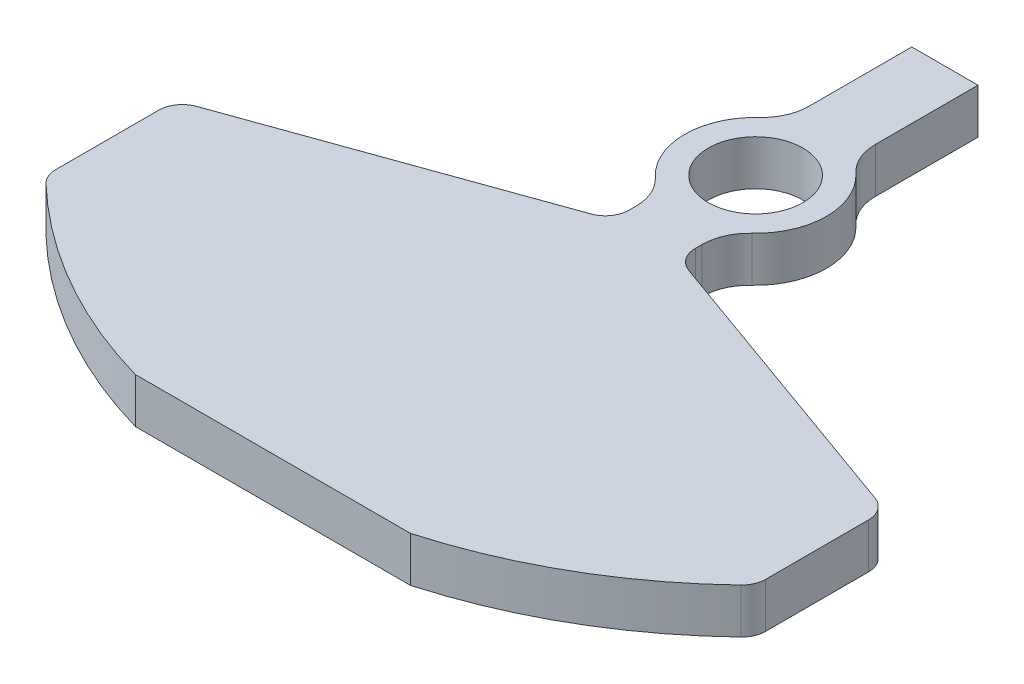
ISO-10303-21;
HEADER;
FILE_DESCRIPTION(('STEP AP214'),'2;1');
FILE_NAME('part.step','',(''),(''),'','','');
FILE_SCHEMA(('AUTOMOTIVE_DESIGN { 1 0 10303 214 1 1 1 1 }'));
ENDSEC;
DATA;
#1=APPLICATION_CONTEXT('core data for automotive mechanical design processes');
#2=APPLICATION_PROTOCOL_DEFINITION('international standard','automotive_design',2000,#1);
#3=PRODUCT_CONTEXT('',#1,'mechanical');
#4=PRODUCT('Part','Part','',(#3));
#5=PRODUCT_RELATED_PRODUCT_CATEGORY('part','',(#4));
#6=PRODUCT_DEFINITION_FORMATION('','',#4);
#7=PRODUCT_DEFINITION_CONTEXT('part definition',#1,'design');
#8=PRODUCT_DEFINITION('design','',#6,#7);
#9=PRODUCT_DEFINITION_SHAPE('','',#8);
#10=(LENGTH_UNIT() NAMED_UNIT(*) SI_UNIT(.MILLI.,.METRE.));
#11=(NAMED_UNIT(*) PLANE_ANGLE_UNIT() SI_UNIT($,.RADIAN.));
#12=(NAMED_UNIT(*) SI_UNIT($,.STERADIAN.) SOLID_ANGLE_UNIT());
#13=UNCERTAINTY_MEASURE_WITH_UNIT(LENGTH_MEASURE(1.E-05),#10,'distance_accuracy_value','');
#14=(GEOMETRIC_REPRESENTATION_CONTEXT(3) GLOBAL_UNCERTAINTY_ASSIGNED_CONTEXT((#13)) GLOBAL_UNIT_ASSIGNED_CONTEXT((#10,
#11,#12)) REPRESENTATION_CONTEXT('',''));
#15=CARTESIAN_POINT('',(0.,0.,0.));
#16=DIRECTION('',(0.,0.,1.));
#17=DIRECTION('',(1.,0.,0.));
#18=AXIS2_PLACEMENT_3D('',#15,#16,#17);
#19=CARTESIAN_POINT('',(0.,9.525,0.));
#20=DIRECTION('',(0.,1.,0.));
#21=DIRECTION('',(0.,0.,1.));
#22=AXIS2_PLACEMENT_3D('',#19,#20,#21);
#23=PLANE('',#22);
#24=CARTESIAN_POINT('',(0.,9.525,0.));
#25=DIRECTION('',(0.,1.,0.));
#26=DIRECTION('',(0.,0.,1.));
#27=AXIS2_PLACEMENT_3D('',#24,#25,#26);
#28=CIRCLE('',#27,106.066017177982);
#29=CARTESIAN_POINT('',(29.086079144498,9.525,102.));
#30=VERTEX_POINT('',#29);
#31=CARTESIAN_POINT('',(73.4630829409616,9.525,76.5060484197779));
#32=VERTEX_POINT('',#31);
#33=EDGE_CURVE('E238',#30,#32,#28,.T.);
#34=ORIENTED_EDGE('',*,*,#33,.T.);
#35=CARTESIAN_POINT('',(70.,9.525,72.8995187104838));
#36=DIRECTION('',(0.,1.,0.));
#37=DIRECTION('',(0.,0.,1.));
#38=AXIS2_PLACEMENT_3D('',#35,#36,#37);
#39=CIRCLE('',#38,5.);
#40=CARTESIAN_POINT('',(75.,9.525,72.8995187104838));
#41=VERTEX_POINT('',#40);
#42=EDGE_CURVE('E368',#32,#41,#39,.T.);
#43=ORIENTED_EDGE('',*,*,#42,.T.);
#44=DIRECTION('',(0.,0.,-1.));
#45=VECTOR('',#44,1.);
#46=CARTESIAN_POINT('',(75.,9.525,47.6323364101277));
#47=LINE('',#46,#45);
#48=CARTESIAN_POINT('',(75.,9.525,51.1520253851288));
#49=VERTEX_POINT('',#48);
#50=EDGE_CURVE('E241',#41,#49,#47,.T.);
#51=ORIENTED_EDGE('',*,*,#50,.T.);
#52=CARTESIAN_POINT('',(70.,9.525,51.1520253851288));
#53=DIRECTION('',(0.,1.,0.));
#54=DIRECTION('',(0.,0.,1.));
#55=AXIS2_PLACEMENT_3D('',#52,#53,#54);
#56=CIRCLE('',#55,5.);
#57=CARTESIAN_POINT('',(71.686599780665,9.525,46.4450750794786));
#58=VERTEX_POINT('',#57);
#59=EDGE_CURVE('E365',#49,#58,#56,.T.);
#60=ORIENTED_EDGE('',*,*,#59,.T.);
#61=DIRECTION('',(-0.941390061130045,0.,-0.337319956133003));
#62=VECTOR('',#61,1.);
#63=CARTESIAN_POINT('',(6.99999999999999,9.525,23.2664991614216));
#64=LINE('',#63,#62);
#65=CARTESIAN_POINT('',(10.313400219335,9.525,24.4537604920708));
#66=VERTEX_POINT('',#65);
#67=EDGE_CURVE('E244',#58,#66,#64,.T.);
#68=ORIENTED_EDGE('',*,*,#67,.T.);
#69=CARTESIAN_POINT('',(12.,9.525,19.7468101864206));
#70=DIRECTION('',(0.,1.,0.));
#71=DIRECTION('',(0.,0.,1.));
#72=AXIS2_PLACEMENT_3D('',#69,#70,#71);
#73=CIRCLE('',#72,5.);
#74=CARTESIAN_POINT('',(7.,9.525,19.7468101864205));
#75=VERTEX_POINT('',#74);
#76=EDGE_CURVE('E386',#66,#75,#73,.F.);
#77=ORIENTED_EDGE('',*,*,#76,.T.);
#78=DIRECTION('',(0.,0.,-1.));
#79=VECTOR('',#78,1.);
#80=CARTESIAN_POINT('',(7.,9.525,13.2664991614216));
#81=LINE('',#80,#79);
#82=CARTESIAN_POINT('',(7.,9.525,18.3303027798234));
#83=VERTEX_POINT('',#82);
#84=EDGE_CURVE('E247',#75,#83,#81,.T.);
#85=ORIENTED_EDGE('',*,*,#84,.T.);
#86=CARTESIAN_POINT('',(17.,9.525,18.3303027798234));
#87=DIRECTION('',(0.,1.,0.));
#88=DIRECTION('',(0.,0.,1.));
#89=AXIS2_PLACEMENT_3D('',#86,#87,#88);
#90=CIRCLE('',#89,10.);
#91=CARTESIAN_POINT('',(10.2,9.525,10.998181667894));
#92=VERTEX_POINT('',#91);
#93=EDGE_CURVE('E334',#83,#92,#90,.F.);
#94=ORIENTED_EDGE('',*,*,#93,.T.);
#95=CARTESIAN_POINT('',(0.,9.525,0.));
#96=DIRECTION('',(0.,1.,0.));
#97=DIRECTION('',(0.,0.,1.));
#98=AXIS2_PLACEMENT_3D('',#95,#96,#97);
#99=CIRCLE('',#98,15.);
#100=CARTESIAN_POINT('',(10.2,9.525,-10.998181667894));
#101=VERTEX_POINT('',#100);
#102=EDGE_CURVE('E249',#92,#101,#99,.T.);
#103=ORIENTED_EDGE('',*,*,#102,.T.);
#104=CARTESIAN_POINT('',(17.,9.525,-18.3303027798234));
#105=DIRECTION('',(0.,1.,0.));
#106=DIRECTION('',(0.,0.,1.));
#107=AXIS2_PLACEMENT_3D('',#104,#105,#106);
#108=CIRCLE('',#107,10.);
#109=CARTESIAN_POINT('',(7.,9.525,-18.3303027798234));
#110=VERTEX_POINT('',#109);
#111=EDGE_CURVE('E329',#101,#110,#108,.F.);
#112=ORIENTED_EDGE('',*,*,#111,.T.);
#113=DIRECTION('',(0.,0.,-1.));
#114=VECTOR('',#113,1.);
#115=CARTESIAN_POINT('',(7.,9.525,-40.));
#116=LINE('',#115,#114);
#117=CARTESIAN_POINT('',(7.,9.525,-40.));
#118=VERTEX_POINT('',#117);
#119=EDGE_CURVE('E252',#110,#118,#116,.T.);
#120=ORIENTED_EDGE('',*,*,#119,.T.);
#121=DIRECTION('',(-1.,0.,0.));
#122=VECTOR('',#121,1.);
#123=CARTESIAN_POINT('',(-7.,9.525,-40.));
#124=LINE('',#123,#122);
#125=CARTESIAN_POINT('',(-7.,9.525,-40.));
#126=VERTEX_POINT('',#125);
#127=EDGE_CURVE('E254',#118,#126,#124,.T.);
#128=ORIENTED_EDGE('',*,*,#127,.T.);
#129=DIRECTION('',(0.,0.,1.));
#130=VECTOR('',#129,1.);
#131=CARTESIAN_POINT('',(-7.,9.525,-40.));
#132=LINE('',#131,#130);
#133=CARTESIAN_POINT('',(-7.,9.525,-18.3303027798234));
#134=VERTEX_POINT('',#133);
#135=EDGE_CURVE('E219',#126,#134,#132,.T.);
#136=ORIENTED_EDGE('',*,*,#135,.T.);
#137=CARTESIAN_POINT('',(-17.,9.525,-18.3303027798234));
#138=DIRECTION('',(0.,1.,0.));
#139=DIRECTION('',(0.,0.,1.));
#140=AXIS2_PLACEMENT_3D('',#137,#138,#139);
#141=CIRCLE('',#140,10.);
#142=CARTESIAN_POINT('',(-10.2,9.525,-10.998181667894));
#143=VERTEX_POINT('',#142);
#144=EDGE_CURVE('E325',#134,#143,#141,.F.);
#145=ORIENTED_EDGE('',*,*,#144,.T.);
#146=CARTESIAN_POINT('',(0.,9.525,0.));
#147=DIRECTION('',(0.,1.,0.));
#148=DIRECTION('',(0.,0.,1.));
#149=AXIS2_PLACEMENT_3D('',#146,#147,#148);
#150=CIRCLE('',#149,15.);
#151=CARTESIAN_POINT('',(-10.2,9.525,10.998181667894));
#152=VERTEX_POINT('',#151);
#153=EDGE_CURVE('E222',#143,#152,#150,.T.);
#154=ORIENTED_EDGE('',*,*,#153,.T.);
#155=CARTESIAN_POINT('',(-17.,9.525,18.3303027798234));
#156=DIRECTION('',(0.,1.,0.));
#157=DIRECTION('',(0.,0.,1.));
#158=AXIS2_PLACEMENT_3D('',#155,#156,#157);
#159=CIRCLE('',#158,10.);
#160=CARTESIAN_POINT('',(-7.,9.525,18.3303027798234));
#161=VERTEX_POINT('',#160);
#162=EDGE_CURVE('E338',#152,#161,#159,.F.);
#163=ORIENTED_EDGE('',*,*,#162,.T.);
#164=DIRECTION('',(0.,0.,1.));
#165=VECTOR('',#164,1.);
#166=CARTESIAN_POINT('',(-7.,9.525,13.2664991614216));
#167=LINE('',#166,#165);
#168=CARTESIAN_POINT('',(-7.,9.525,19.7468101864205));
#169=VERTEX_POINT('',#168);
#170=EDGE_CURVE('E226',#161,#169,#167,.T.);
#171=ORIENTED_EDGE('',*,*,#170,.T.);
#172=CARTESIAN_POINT('',(-12.,9.525,19.7468101864205));
#173=DIRECTION('',(0.,1.,0.));
#174=DIRECTION('',(0.,0.,1.));
#175=AXIS2_PLACEMENT_3D('',#172,#173,#174);
#176=CIRCLE('',#175,5.);
#177=CARTESIAN_POINT('',(-10.313400219335,9.525,24.4537604920708));
#178=VERTEX_POINT('',#177);
#179=EDGE_CURVE('E11',#169,#178,#176,.F.);
#180=ORIENTED_EDGE('',*,*,#179,.T.);
#181=DIRECTION('',(-0.941390061130045,0.,0.337319956133003));
#182=VECTOR('',#181,1.);
#183=CARTESIAN_POINT('',(-75.,9.525,47.6323364101277));
#184=LINE('',#183,#182);
#185=CARTESIAN_POINT('',(-71.686599780665,9.525,46.4450750794786));
#186=VERTEX_POINT('',#185);
#187=EDGE_CURVE('E229',#178,#186,#184,.T.);
#188=ORIENTED_EDGE('',*,*,#187,.T.);
#189=CARTESIAN_POINT('',(-70.,9.525,51.1520253851288));
#190=DIRECTION('',(0.,1.,0.));
#191=DIRECTION('',(0.,0.,1.));
#192=AXIS2_PLACEMENT_3D('',#189,#190,#191);
#193=CIRCLE('',#192,5.);
#194=CARTESIAN_POINT('',(-75.,9.525,51.1520253851288));
#195=VERTEX_POINT('',#194);
#196=EDGE_CURVE('E363',#186,#195,#193,.T.);
#197=ORIENTED_EDGE('',*,*,#196,.T.);
#198=DIRECTION('',(0.,0.,1.));
#199=VECTOR('',#198,1.);
#200=CARTESIAN_POINT('',(-75.,9.525,47.6323364101277));
#201=LINE('',#200,#199);
#202=CARTESIAN_POINT('',(-75.,9.525,72.8995187104838));
#203=VERTEX_POINT('',#202);
#204=EDGE_CURVE('E232',#195,#203,#201,.T.);
#205=ORIENTED_EDGE('',*,*,#204,.T.);
#206=CARTESIAN_POINT('',(-70.,9.525,72.8995187104838));
#207=DIRECTION('',(0.,1.,0.));
#208=DIRECTION('',(0.,0.,1.));
#209=AXIS2_PLACEMENT_3D('',#206,#207,#208);
#210=CIRCLE('',#209,5.);
#211=CARTESIAN_POINT('',(-73.4630829409616,9.525,76.5060484197779));
#212=VERTEX_POINT('',#211);
#213=EDGE_CURVE('E50',#203,#212,#210,.T.);
#214=ORIENTED_EDGE('',*,*,#213,.T.);
#215=CARTESIAN_POINT('',(0.,9.525,0.));
#216=DIRECTION('',(0.,1.,0.));
#217=DIRECTION('',(0.,0.,1.));
#218=AXIS2_PLACEMENT_3D('',#215,#216,#217);
#219=CIRCLE('',#218,106.066017177982);
#220=CARTESIAN_POINT('',(-29.086079144498,9.525,102.));
#221=VERTEX_POINT('',#220);
#222=EDGE_CURVE('E234',#212,#221,#219,.T.);
#223=ORIENTED_EDGE('',*,*,#222,.T.);
#224=DIRECTION('',(1.,0.,0.));
#225=VECTOR('',#224,1.);
#226=CARTESIAN_POINT('',(-29.086079144498,9.525,102.));
#227=LINE('',#226,#225);
#228=EDGE_CURVE('E236',#221,#30,#227,.T.);
#229=ORIENTED_EDGE('',*,*,#228,.T.);
#230=EDGE_LOOP('',(#34,#43,#51,#60,#68,#77,#85,#94,#103,#112,#120,#128,#136,#145,#154,#163,#171,
#180,#188,#197,#205,#214,#223,#229));
#231=FACE_BOUND('',#230,.T.);
#232=CARTESIAN_POINT('',(0.,9.525,0.));
#233=DIRECTION('',(0.,1.,0.));
#234=DIRECTION('',(0.,0.,1.));
#235=AXIS2_PLACEMENT_3D('',#232,#233,#234);
#236=CIRCLE('',#235,10.);
#237=CARTESIAN_POINT('',(0.,9.525,10.));
#238=VERTEX_POINT('',#237);
#239=EDGE_CURVE('E211',#238,#238,#236,.T.);
#240=ORIENTED_EDGE('',*,*,#239,.F.);
#241=EDGE_LOOP('',(#240));
#242=FACE_BOUND('',#241,.T.);
#243=ADVANCED_FACE('F35',(#231,#242),#23,.T.);
#244=CARTESIAN_POINT('',(0.,0.,0.));
#245=DIRECTION('',(0.,1.,0.));
#246=DIRECTION('',(0.,0.,1.));
#247=AXIS2_PLACEMENT_3D('',#244,#245,#246);
#248=PLANE('',#247);
#249=DIRECTION('',(0.,0.,-1.));
#250=VECTOR('',#249,1.);
#251=CARTESIAN_POINT('',(75.,0.,47.6323364101277));
#252=LINE('',#251,#250);
#253=CARTESIAN_POINT('',(75.,0.,72.8995187104838));
#254=VERTEX_POINT('',#253);
#255=CARTESIAN_POINT('',(75.,0.,51.1520253851288));
#256=VERTEX_POINT('',#255);
#257=EDGE_CURVE('E277',#254,#256,#252,.T.);
#258=ORIENTED_EDGE('',*,*,#257,.F.);
#259=CARTESIAN_POINT('',(70.,0.,72.8995187104838));
#260=DIRECTION('',(0.,1.,0.));
#261=DIRECTION('',(0.,0.,1.));
#262=AXIS2_PLACEMENT_3D('',#259,#260,#261);
#263=CIRCLE('',#262,5.);
#264=CARTESIAN_POINT('',(73.4630829409616,0.,76.5060484197779));
#265=VERTEX_POINT('',#264);
#266=EDGE_CURVE('E359',#254,#265,#263,.F.);
#267=ORIENTED_EDGE('',*,*,#266,.T.);
#268=CARTESIAN_POINT('',(0.,0.,0.));
#269=DIRECTION('',(0.,1.,0.));
#270=DIRECTION('',(0.,0.,1.));
#271=AXIS2_PLACEMENT_3D('',#268,#269,#270);
#272=CIRCLE('',#271,106.066017177982);
#273=CARTESIAN_POINT('',(29.086079144498,0.,102.));
#274=VERTEX_POINT('',#273);
#275=EDGE_CURVE('E274',#274,#265,#272,.T.);
#276=ORIENTED_EDGE('',*,*,#275,.F.);
#277=DIRECTION('',(1.,0.,0.));
#278=VECTOR('',#277,1.);
#279=CARTESIAN_POINT('',(-29.086079144498,0.,102.));
#280=LINE('',#279,#278);
#281=CARTESIAN_POINT('',(-29.086079144498,0.,102.));
#282=VERTEX_POINT('',#281);
#283=EDGE_CURVE('E272',#282,#274,#280,.T.);
#284=ORIENTED_EDGE('',*,*,#283,.F.);
#285=CARTESIAN_POINT('',(0.,0.,0.));
#286=DIRECTION('',(0.,1.,0.));
#287=DIRECTION('',(0.,0.,1.));
#288=AXIS2_PLACEMENT_3D('',#285,#286,#287);
#289=CIRCLE('',#288,106.066017177982);
#290=CARTESIAN_POINT('',(-73.4630829409616,0.,76.5060484197779));
#291=VERTEX_POINT('',#290);
#292=EDGE_CURVE('E270',#291,#282,#289,.T.);
#293=ORIENTED_EDGE('',*,*,#292,.F.);
#294=CARTESIAN_POINT('',(-70.,0.,72.8995187104838));
#295=DIRECTION('',(0.,1.,0.));
#296=DIRECTION('',(0.,0.,1.));
#297=AXIS2_PLACEMENT_3D('',#294,#295,#296);
#298=CIRCLE('',#297,5.);
#299=CARTESIAN_POINT('',(-75.,0.,72.8995187104838));
#300=VERTEX_POINT('',#299);
#301=EDGE_CURVE('E357',#291,#300,#298,.F.);
#302=ORIENTED_EDGE('',*,*,#301,.T.);
#303=DIRECTION('',(0.,0.,1.));
#304=VECTOR('',#303,1.);
#305=CARTESIAN_POINT('',(-75.,0.,47.6323364101277));
#306=LINE('',#305,#304);
#307=CARTESIAN_POINT('',(-75.,0.,51.1520253851288));
#308=VERTEX_POINT('',#307);
#309=EDGE_CURVE('E268',#308,#300,#306,.T.);
#310=ORIENTED_EDGE('',*,*,#309,.F.);
#311=CARTESIAN_POINT('',(-70.,0.,51.1520253851288));
#312=DIRECTION('',(0.,1.,0.));
#313=DIRECTION('',(0.,0.,1.));
#314=AXIS2_PLACEMENT_3D('',#311,#312,#313);
#315=CIRCLE('',#314,5.);
#316=CARTESIAN_POINT('',(-71.686599780665,0.,46.4450750794786));
#317=VERTEX_POINT('',#316);
#318=EDGE_CURVE('E353',#308,#317,#315,.F.);
#319=ORIENTED_EDGE('',*,*,#318,.T.);
#320=DIRECTION('',(-0.941390061130045,0.,0.337319956133003));
#321=VECTOR('',#320,1.);
#322=CARTESIAN_POINT('',(-75.,0.,47.6323364101277));
#323=LINE('',#322,#321);
#324=CARTESIAN_POINT('',(-10.313400219335,0.,24.4537604920708));
#325=VERTEX_POINT('',#324);
#326=EDGE_CURVE('E265',#325,#317,#323,.T.);
#327=ORIENTED_EDGE('',*,*,#326,.F.);
#328=CARTESIAN_POINT('',(-12.,0.,19.7468101864205));
#329=DIRECTION('',(0.,1.,0.));
#330=DIRECTION('',(0.,0.,1.));
#331=AXIS2_PLACEMENT_3D('',#328,#329,#330);
#332=CIRCLE('',#331,5.);
#333=CARTESIAN_POINT('',(-7.,0.,19.7468101864205));
#334=VERTEX_POINT('',#333);
#335=EDGE_CURVE('E43',#325,#334,#332,.T.);
#336=ORIENTED_EDGE('',*,*,#335,.T.);
#337=DIRECTION('',(0.,0.,1.));
#338=VECTOR('',#337,1.);
#339=CARTESIAN_POINT('',(-7.,0.,13.2664991614216));
#340=LINE('',#339,#338);
#341=CARTESIAN_POINT('',(-7.,0.,18.3303027798234));
#342=VERTEX_POINT('',#341);
#343=EDGE_CURVE('E262',#342,#334,#340,.T.);
#344=ORIENTED_EDGE('',*,*,#343,.F.);
#345=CARTESIAN_POINT('',(-17.,0.,18.3303027798234));
#346=DIRECTION('',(0.,1.,0.));
#347=DIRECTION('',(0.,0.,1.));
#348=AXIS2_PLACEMENT_3D('',#345,#346,#347);
#349=CIRCLE('',#348,10.);
#350=CARTESIAN_POINT('',(-10.2,0.,10.998181667894));
#351=VERTEX_POINT('',#350);
#352=EDGE_CURVE('E336',#342,#351,#349,.T.);
#353=ORIENTED_EDGE('',*,*,#352,.T.);
#354=CARTESIAN_POINT('',(0.,0.,0.));
#355=DIRECTION('',(0.,1.,0.));
#356=DIRECTION('',(0.,0.,1.));
#357=AXIS2_PLACEMENT_3D('',#354,#355,#356);
#358=CIRCLE('',#357,15.);
#359=CARTESIAN_POINT('',(-10.2,0.,-10.998181667894));
#360=VERTEX_POINT('',#359);
#361=EDGE_CURVE('E259',#360,#351,#358,.T.);
#362=ORIENTED_EDGE('',*,*,#361,.F.);
#363=CARTESIAN_POINT('',(-17.,0.,-18.3303027798234));
#364=DIRECTION('',(0.,1.,0.));
#365=DIRECTION('',(0.,0.,1.));
#366=AXIS2_PLACEMENT_3D('',#363,#364,#365);
#367=CIRCLE('',#366,10.);
#368=CARTESIAN_POINT('',(-7.,0.,-18.3303027798234));
#369=VERTEX_POINT('',#368);
#370=EDGE_CURVE('E323',#360,#369,#367,.T.);
#371=ORIENTED_EDGE('',*,*,#370,.T.);
#372=DIRECTION('',(0.,0.,1.));
#373=VECTOR('',#372,1.);
#374=CARTESIAN_POINT('',(-7.,0.,-40.));
#375=LINE('',#374,#373);
#376=CARTESIAN_POINT('',(-7.,0.,-40.));
#377=VERTEX_POINT('',#376);
#378=EDGE_CURVE('E217',#377,#369,#375,.T.);
#379=ORIENTED_EDGE('',*,*,#378,.F.);
#380=DIRECTION('',(-1.,0.,0.));
#381=VECTOR('',#380,1.);
#382=CARTESIAN_POINT('',(-7.,0.,-40.));
#383=LINE('',#382,#381);
#384=CARTESIAN_POINT('',(7.,0.,-40.));
#385=VERTEX_POINT('',#384);
#386=EDGE_CURVE('E223',#385,#377,#383,.T.);
#387=ORIENTED_EDGE('',*,*,#386,.F.);
#388=DIRECTION('',(0.,0.,-1.));
#389=VECTOR('',#388,1.);
#390=CARTESIAN_POINT('',(7.,0.,-40.));
#391=LINE('',#390,#389);
#392=CARTESIAN_POINT('',(7.,0.,-18.3303027798234));
#393=VERTEX_POINT('',#392);
#394=EDGE_CURVE('E288',#393,#385,#391,.T.);
#395=ORIENTED_EDGE('',*,*,#394,.F.);
#396=CARTESIAN_POINT('',(17.,0.,-18.3303027798234));
#397=DIRECTION('',(0.,1.,0.));
#398=DIRECTION('',(0.,0.,1.));
#399=AXIS2_PLACEMENT_3D('',#396,#397,#398);
#400=CIRCLE('',#399,10.);
#401=CARTESIAN_POINT('',(10.2,0.,-10.998181667894));
#402=VERTEX_POINT('',#401);
#403=EDGE_CURVE('E327',#393,#402,#400,.T.);
#404=ORIENTED_EDGE('',*,*,#403,.T.);
#405=CARTESIAN_POINT('',(0.,0.,0.));
#406=DIRECTION('',(0.,1.,0.));
#407=DIRECTION('',(0.,0.,1.));
#408=AXIS2_PLACEMENT_3D('',#405,#406,#407);
#409=CIRCLE('',#408,15.);
#410=CARTESIAN_POINT('',(10.2,0.,10.998181667894));
#411=VERTEX_POINT('',#410);
#412=EDGE_CURVE('E285',#411,#402,#409,.T.);
#413=ORIENTED_EDGE('',*,*,#412,.F.);
#414=CARTESIAN_POINT('',(17.,0.,18.3303027798234));
#415=DIRECTION('',(0.,1.,0.));
#416=DIRECTION('',(0.,0.,1.));
#417=AXIS2_PLACEMENT_3D('',#414,#415,#416);
#418=CIRCLE('',#417,10.);
#419=CARTESIAN_POINT('',(7.,0.,18.3303027798234));
#420=VERTEX_POINT('',#419);
#421=EDGE_CURVE('E331',#411,#420,#418,.T.);
#422=ORIENTED_EDGE('',*,*,#421,.T.);
#423=DIRECTION('',(0.,0.,-1.));
#424=VECTOR('',#423,1.);
#425=CARTESIAN_POINT('',(7.,0.,13.2664991614216));
#426=LINE('',#425,#424);
#427=CARTESIAN_POINT('',(7.,0.,19.7468101864205));
#428=VERTEX_POINT('',#427);
#429=EDGE_CURVE('E283',#428,#420,#426,.T.);
#430=ORIENTED_EDGE('',*,*,#429,.F.);
#431=CARTESIAN_POINT('',(12.,0.,19.7468101864206));
#432=DIRECTION('',(0.,1.,0.));
#433=DIRECTION('',(0.,0.,1.));
#434=AXIS2_PLACEMENT_3D('',#431,#432,#433);
#435=CIRCLE('',#434,5.);
#436=CARTESIAN_POINT('',(10.313400219335,0.,24.4537604920708));
#437=VERTEX_POINT('',#436);
#438=EDGE_CURVE('E384',#428,#437,#435,.T.);
#439=ORIENTED_EDGE('',*,*,#438,.T.);
#440=DIRECTION('',(-0.941390061130045,0.,-0.337319956133003));
#441=VECTOR('',#440,1.);
#442=CARTESIAN_POINT('',(6.99999999999999,0.,23.2664991614216));
#443=LINE('',#442,#441);
#444=CARTESIAN_POINT('',(71.686599780665,0.,46.4450750794786));
#445=VERTEX_POINT('',#444);
#446=EDGE_CURVE('E280',#445,#437,#443,.T.);
#447=ORIENTED_EDGE('',*,*,#446,.F.);
#448=CARTESIAN_POINT('',(70.,0.,51.1520253851288));
#449=DIRECTION('',(0.,1.,0.));
#450=DIRECTION('',(0.,0.,1.));
#451=AXIS2_PLACEMENT_3D('',#448,#449,#450);
#452=CIRCLE('',#451,5.);
#453=EDGE_CURVE('E355',#445,#256,#452,.F.);
#454=ORIENTED_EDGE('',*,*,#453,.T.);
#455=EDGE_LOOP('',(#258,#267,#276,#284,#293,#302,#310,#319,#327,#336,#344,#353,#362,#371,#379,
#387,#395,#404,#413,#422,#430,#439,#447,#454));
#456=FACE_BOUND('',#455,.T.);
#457=CARTESIAN_POINT('',(0.,0.,0.));
#458=DIRECTION('',(0.,1.,0.));
#459=DIRECTION('',(0.,0.,1.));
#460=AXIS2_PLACEMENT_3D('',#457,#458,#459);
#461=CIRCLE('',#460,10.);
#462=CARTESIAN_POINT('',(0.,0.,10.));
#463=VERTEX_POINT('',#462);
#464=EDGE_CURVE('E207',#463,#463,#461,.T.);
#465=ORIENTED_EDGE('',*,*,#464,.T.);
#466=EDGE_LOOP('',(#465));
#467=FACE_BOUND('',#466,.T.);
#468=ADVANCED_FACE('F391',(#456,#467),#248,.F.);
#469=CARTESIAN_POINT('',(-7.,9.525,-40.));
#470=DIRECTION('',(1.,0.,0.));
#471=DIRECTION('',(0.,0.,-1.));
#472=AXIS2_PLACEMENT_3D('',#469,#470,#471);
#473=PLANE('',#472);
#474=ORIENTED_EDGE('',*,*,#378,.T.);
#475=DIRECTION('',(0.,1.,0.));
#476=VECTOR('',#475,1.);
#477=CARTESIAN_POINT('',(-7.,9.525,-18.3303027798234));
#478=LINE('',#477,#476);
#479=EDGE_CURVE('E307',#369,#134,#478,.T.);
#480=ORIENTED_EDGE('',*,*,#479,.T.);
#481=ORIENTED_EDGE('',*,*,#135,.F.);
#482=DIRECTION('',(0.,-1.,0.));
#483=VECTOR('',#482,1.);
#484=CARTESIAN_POINT('',(-7.,9.525,-40.));
#485=LINE('',#484,#483);
#486=EDGE_CURVE('E256',#126,#377,#485,.T.);
#487=ORIENTED_EDGE('',*,*,#486,.T.);
#488=EDGE_LOOP('',(#474,#480,#481,#487));
#489=FACE_BOUND('',#488,.T.);
#490=ADVANCED_FACE('F507',(#489),#473,.F.);
#491=CARTESIAN_POINT('',(0.,9.525,0.));
#492=DIRECTION('',(0.,-1.,0.));
#493=DIRECTION('',(0.,0.,-1.));
#494=AXIS2_PLACEMENT_3D('',#491,#492,#493);
#495=CYLINDRICAL_SURFACE('',#494,15.);
#496=ORIENTED_EDGE('',*,*,#153,.F.);
#497=DIRECTION('',(0.,-1.,0.));
#498=VECTOR('',#497,1.);
#499=CARTESIAN_POINT('',(-10.2,9.525,-10.998181667894));
#500=LINE('',#499,#498);
#501=EDGE_CURVE('E304',#143,#360,#500,.T.);
#502=ORIENTED_EDGE('',*,*,#501,.T.);
#503=ORIENTED_EDGE('',*,*,#361,.T.);
#504=DIRECTION('',(0.,-1.,0.));
#505=VECTOR('',#504,1.);
#506=CARTESIAN_POINT('',(-10.2,9.525,10.998181667894));
#507=LINE('',#506,#505);
#508=EDGE_CURVE('E302',#351,#152,#507,.F.);
#509=ORIENTED_EDGE('',*,*,#508,.T.);
#510=EDGE_LOOP('',(#496,#502,#503,#509));
#511=FACE_BOUND('',#510,.T.);
#512=ADVANCED_FACE('F488',(#511),#495,.T.);
#513=CARTESIAN_POINT('',(-7.,9.525,13.2664991614216));
#514=DIRECTION('',(1.,0.,0.));
#515=DIRECTION('',(0.,0.,-1.));
#516=AXIS2_PLACEMENT_3D('',#513,#514,#515);
#517=PLANE('',#516);
#518=ORIENTED_EDGE('',*,*,#343,.T.);
#519=DIRECTION('',(0.,-1.,0.));
#520=VECTOR('',#519,1.);
#521=CARTESIAN_POINT('',(-7.,9.525,19.7468101864205));
#522=LINE('',#521,#520);
#523=EDGE_CURVE('E382',#334,#169,#522,.F.);
#524=ORIENTED_EDGE('',*,*,#523,.T.);
#525=ORIENTED_EDGE('',*,*,#170,.F.);
#526=DIRECTION('',(0.,1.,0.));
#527=VECTOR('',#526,1.);
#528=CARTESIAN_POINT('',(-7.,0.,18.3303027798234));
#529=LINE('',#528,#527);
#530=EDGE_CURVE('E320',#161,#342,#529,.F.);
#531=ORIENTED_EDGE('',*,*,#530,.T.);
#532=EDGE_LOOP('',(#518,#524,#525,#531));
#533=FACE_BOUND('',#532,.T.);
#534=ADVANCED_FACE('F397',(#533),#517,.F.);
#535=CARTESIAN_POINT('',(-75.,9.525,47.6323364101277));
#536=DIRECTION('',(0.337319956133003,0.,0.941390061130045));
#537=DIRECTION('',(0.941390061130045,0.,-0.337319956133003));
#538=AXIS2_PLACEMENT_3D('',#535,#536,#537);
#539=PLANE('',#538);
#540=ORIENTED_EDGE('',*,*,#326,.T.);
#541=DIRECTION('',(0.,-1.,0.));
#542=VECTOR('',#541,1.);
#543=CARTESIAN_POINT('',(-71.686599780665,9.525,46.4450750794786));
#544=LINE('',#543,#542);
#545=EDGE_CURVE('E380',#317,#186,#544,.F.);
#546=ORIENTED_EDGE('',*,*,#545,.T.);
#547=ORIENTED_EDGE('',*,*,#187,.F.);
#548=DIRECTION('',(0.,-1.,0.));
#549=VECTOR('',#548,1.);
#550=CARTESIAN_POINT('',(-10.313400219335,0.,24.4537604920708));
#551=LINE('',#550,#549);
#552=EDGE_CURVE('E377',#178,#325,#551,.T.);
#553=ORIENTED_EDGE('',*,*,#552,.T.);
#554=EDGE_LOOP('',(#540,#546,#547,#553));
#555=FACE_BOUND('',#554,.T.);
#556=ADVANCED_FACE('F405',(#555),#539,.F.);
#557=CARTESIAN_POINT('',(-75.,9.525,47.6323364101277));
#558=DIRECTION('',(1.,0.,0.));
#559=DIRECTION('',(0.,0.,-1.));
#560=AXIS2_PLACEMENT_3D('',#557,#558,#559);
#561=PLANE('',#560);
#562=ORIENTED_EDGE('',*,*,#309,.T.);
#563=DIRECTION('',(0.,-1.,0.));
#564=VECTOR('',#563,1.);
#565=CARTESIAN_POINT('',(-75.,9.525,72.8995187104838));
#566=LINE('',#565,#564);
#567=EDGE_CURVE('E58',#300,#203,#566,.F.);
#568=ORIENTED_EDGE('',*,*,#567,.T.);
#569=ORIENTED_EDGE('',*,*,#204,.F.);
#570=DIRECTION('',(0.,-1.,0.));
#571=VECTOR('',#570,1.);
#572=CARTESIAN_POINT('',(-75.,9.525,51.1520253851288));
#573=LINE('',#572,#571);
#574=EDGE_CURVE('E373',#195,#308,#573,.T.);
#575=ORIENTED_EDGE('',*,*,#574,.T.);
#576=EDGE_LOOP('',(#562,#568,#569,#575));
#577=FACE_BOUND('',#576,.T.);
#578=ADVANCED_FACE('F410',(#577),#561,.F.);
#579=CARTESIAN_POINT('',(0.,9.525,0.));
#580=DIRECTION('',(0.,-1.,0.));
#581=DIRECTION('',(0.,0.,-1.));
#582=AXIS2_PLACEMENT_3D('',#579,#580,#581);
#583=CYLINDRICAL_SURFACE('',#582,106.066017177982);
#584=ORIENTED_EDGE('',*,*,#222,.F.);
#585=DIRECTION('',(0.,-1.,0.));
#586=VECTOR('',#585,1.);
#587=CARTESIAN_POINT('',(-73.4630829409616,9.525,76.5060484197779));
#588=LINE('',#587,#586);
#589=EDGE_CURVE('E370',#212,#291,#588,.T.);
#590=ORIENTED_EDGE('',*,*,#589,.T.);
#591=ORIENTED_EDGE('',*,*,#292,.T.);
#592=DIRECTION('',(0.,-1.,0.));
#593=VECTOR('',#592,1.);
#594=CARTESIAN_POINT('',(-29.086079144498,9.525,102.));
#595=LINE('',#594,#593);
#596=EDGE_CURVE('E299',#221,#282,#595,.T.);
#597=ORIENTED_EDGE('',*,*,#596,.F.);
#598=EDGE_LOOP('',(#584,#590,#591,#597));
#599=FACE_BOUND('',#598,.T.);
#600=ADVANCED_FACE('F418',(#599),#583,.T.);
#601=CARTESIAN_POINT('',(-29.086079144498,9.525,102.));
#602=DIRECTION('',(0.,0.,-1.));
#603=DIRECTION('',(-1.,0.,0.));
#604=AXIS2_PLACEMENT_3D('',#601,#602,#603);
#605=PLANE('',#604);
#606=ORIENTED_EDGE('',*,*,#283,.T.);
#607=DIRECTION('',(0.,-1.,0.));
#608=VECTOR('',#607,1.);
#609=CARTESIAN_POINT('',(29.086079144498,9.525,102.));
#610=LINE('',#609,#608);
#611=EDGE_CURVE('E296',#30,#274,#610,.T.);
#612=ORIENTED_EDGE('',*,*,#611,.F.);
#613=ORIENTED_EDGE('',*,*,#228,.F.);
#614=ORIENTED_EDGE('',*,*,#596,.T.);
#615=EDGE_LOOP('',(#606,#612,#613,#614));
#616=FACE_BOUND('',#615,.T.);
#617=ADVANCED_FACE('F425',(#616),#605,.F.);
#618=CARTESIAN_POINT('',(0.,9.525,0.));
#619=DIRECTION('',(0.,-1.,0.));
#620=DIRECTION('',(0.,0.,-1.));
#621=AXIS2_PLACEMENT_3D('',#618,#619,#620);
#622=CYLINDRICAL_SURFACE('',#621,106.066017177982);
#623=ORIENTED_EDGE('',*,*,#275,.T.);
#624=DIRECTION('',(0.,-1.,0.));
#625=VECTOR('',#624,1.);
#626=CARTESIAN_POINT('',(73.4630829409616,9.525,76.5060484197779));
#627=LINE('',#626,#625);
#628=EDGE_CURVE('E361',#265,#32,#627,.F.);
#629=ORIENTED_EDGE('',*,*,#628,.T.);
#630=ORIENTED_EDGE('',*,*,#33,.F.);
#631=ORIENTED_EDGE('',*,*,#611,.T.);
#632=EDGE_LOOP('',(#623,#629,#630,#631));
#633=FACE_BOUND('',#632,.T.);
#634=ADVANCED_FACE('F428',(#633),#622,.T.);
#635=CARTESIAN_POINT('',(75.,9.525,47.6323364101277));
#636=DIRECTION('',(-1.,0.,0.));
#637=DIRECTION('',(0.,0.,1.));
#638=AXIS2_PLACEMENT_3D('',#635,#636,#637);
#639=PLANE('',#638);
#640=ORIENTED_EDGE('',*,*,#50,.F.);
#641=DIRECTION('',(0.,-1.,0.));
#642=VECTOR('',#641,1.);
#643=CARTESIAN_POINT('',(75.,9.525,72.8995187104838));
#644=LINE('',#643,#642);
#645=EDGE_CURVE('E350',#41,#254,#644,.T.);
#646=ORIENTED_EDGE('',*,*,#645,.T.);
#647=ORIENTED_EDGE('',*,*,#257,.T.);
#648=DIRECTION('',(0.,-1.,0.));
#649=VECTOR('',#648,1.);
#650=CARTESIAN_POINT('',(75.,9.525,51.1520253851288));
#651=LINE('',#650,#649);
#652=EDGE_CURVE('E348',#256,#49,#651,.F.);
#653=ORIENTED_EDGE('',*,*,#652,.T.);
#654=EDGE_LOOP('',(#640,#646,#647,#653));
#655=FACE_BOUND('',#654,.T.);
#656=ADVANCED_FACE('F436',(#655),#639,.F.);
#657=CARTESIAN_POINT('',(6.99999999999999,9.525,23.2664991614216));
#658=DIRECTION('',(-0.337319956133003,0.,0.941390061130045));
#659=DIRECTION('',(0.941390061130045,0.,0.337319956133003));
#660=AXIS2_PLACEMENT_3D('',#657,#658,#659);
#661=PLANE('',#660);
#662=ORIENTED_EDGE('',*,*,#446,.T.);
#663=DIRECTION('',(0.,-1.,0.));
#664=VECTOR('',#663,1.);
#665=CARTESIAN_POINT('',(10.313400219335,9.525,24.4537604920708));
#666=LINE('',#665,#664);
#667=EDGE_CURVE('E346',#437,#66,#666,.F.);
#668=ORIENTED_EDGE('',*,*,#667,.T.);
#669=ORIENTED_EDGE('',*,*,#67,.F.);
#670=DIRECTION('',(0.,-1.,0.));
#671=VECTOR('',#670,1.);
#672=CARTESIAN_POINT('',(71.686599780665,9.525,46.4450750794786));
#673=LINE('',#672,#671);
#674=EDGE_CURVE('E343',#58,#445,#673,.T.);
#675=ORIENTED_EDGE('',*,*,#674,.T.);
#676=EDGE_LOOP('',(#662,#668,#669,#675));
#677=FACE_BOUND('',#676,.T.);
#678=ADVANCED_FACE('F444',(#677),#661,.F.);
#679=CARTESIAN_POINT('',(7.,9.525,13.2664991614216));
#680=DIRECTION('',(-1.,0.,0.));
#681=DIRECTION('',(0.,0.,1.));
#682=AXIS2_PLACEMENT_3D('',#679,#680,#681);
#683=PLANE('',#682);
#684=ORIENTED_EDGE('',*,*,#84,.F.);
#685=DIRECTION('',(0.,-1.,0.));
#686=VECTOR('',#685,1.);
#687=CARTESIAN_POINT('',(7.,0.,19.7468101864205));
#688=LINE('',#687,#686);
#689=EDGE_CURVE('E340',#75,#428,#688,.T.);
#690=ORIENTED_EDGE('',*,*,#689,.T.);
#691=ORIENTED_EDGE('',*,*,#429,.T.);
#692=DIRECTION('',(0.,1.,0.));
#693=VECTOR('',#692,1.);
#694=CARTESIAN_POINT('',(7.,9.525,18.3303027798234));
#695=LINE('',#694,#693);
#696=EDGE_CURVE('E317',#420,#83,#695,.T.);
#697=ORIENTED_EDGE('',*,*,#696,.T.);
#698=EDGE_LOOP('',(#684,#690,#691,#697));
#699=FACE_BOUND('',#698,.T.);
#700=ADVANCED_FACE('F452',(#699),#683,.F.);
#701=CARTESIAN_POINT('',(0.,9.525,0.));
#702=DIRECTION('',(0.,-1.,0.));
#703=DIRECTION('',(0.,0.,-1.));
#704=AXIS2_PLACEMENT_3D('',#701,#702,#703);
#705=CYLINDRICAL_SURFACE('',#704,15.);
#706=ORIENTED_EDGE('',*,*,#412,.T.);
#707=DIRECTION('',(0.,-1.,0.));
#708=VECTOR('',#707,1.);
#709=CARTESIAN_POINT('',(10.2,9.525,-10.998181667894));
#710=LINE('',#709,#708);
#711=EDGE_CURVE('E315',#402,#101,#710,.F.);
#712=ORIENTED_EDGE('',*,*,#711,.T.);
#713=ORIENTED_EDGE('',*,*,#102,.F.);
#714=DIRECTION('',(0.,-1.,0.));
#715=VECTOR('',#714,1.);
#716=CARTESIAN_POINT('',(10.2,9.525,10.998181667894));
#717=LINE('',#716,#715);
#718=EDGE_CURVE('E312',#92,#411,#717,.T.);
#719=ORIENTED_EDGE('',*,*,#718,.T.);
#720=EDGE_LOOP('',(#706,#712,#713,#719));
#721=FACE_BOUND('',#720,.T.);
#722=ADVANCED_FACE('F462',(#721),#705,.T.);
#723=CARTESIAN_POINT('',(7.,9.525,-40.));
#724=DIRECTION('',(-1.,0.,0.));
#725=DIRECTION('',(0.,0.,1.));
#726=AXIS2_PLACEMENT_3D('',#723,#724,#725);
#727=PLANE('',#726);
#728=ORIENTED_EDGE('',*,*,#119,.F.);
#729=DIRECTION('',(0.,1.,0.));
#730=VECTOR('',#729,1.);
#731=CARTESIAN_POINT('',(7.,0.,-18.3303027798234));
#732=LINE('',#731,#730);
#733=EDGE_CURVE('E309',#110,#393,#732,.F.);
#734=ORIENTED_EDGE('',*,*,#733,.T.);
#735=ORIENTED_EDGE('',*,*,#394,.T.);
#736=DIRECTION('',(0.,-1.,0.));
#737=VECTOR('',#736,1.);
#738=CARTESIAN_POINT('',(7.,9.525,-40.));
#739=LINE('',#738,#737);
#740=EDGE_CURVE('E293',#118,#385,#739,.T.);
#741=ORIENTED_EDGE('',*,*,#740,.F.);
#742=EDGE_LOOP('',(#728,#734,#735,#741));
#743=FACE_BOUND('',#742,.T.);
#744=ADVANCED_FACE('F471',(#743),#727,.F.);
#745=CARTESIAN_POINT('',(-7.,9.525,-40.));
#746=DIRECTION('',(0.,0.,1.));
#747=DIRECTION('',(1.,0.,0.));
#748=AXIS2_PLACEMENT_3D('',#745,#746,#747);
#749=PLANE('',#748);
#750=CARTESIAN_POINT('',(0.,4.7625,-40.));
#751=DIRECTION('',(0.,0.,-1.));
#752=DIRECTION('',(-1.,0.,0.));
#753=AXIS2_PLACEMENT_3D('',#750,#751,#752);
#754=CIRCLE('',#753,3.4);
#755=CARTESIAN_POINT('',(-3.4,4.7625,-40.));
#756=VERTEX_POINT('',#755);
#757=EDGE_CURVE('E208',#756,#756,#754,.T.);
#758=ORIENTED_EDGE('',*,*,#757,.F.);
#759=EDGE_LOOP('',(#758));
#760=FACE_BOUND('',#759,.T.);
#761=ORIENTED_EDGE('',*,*,#386,.T.);
#762=ORIENTED_EDGE('',*,*,#486,.F.);
#763=ORIENTED_EDGE('',*,*,#127,.F.);
#764=ORIENTED_EDGE('',*,*,#740,.T.);
#765=EDGE_LOOP('',(#761,#762,#763,#764));
#766=FACE_BOUND('',#765,.T.);
#767=ADVANCED_FACE('F477',(#760,#766),#749,.F.);
#768=CARTESIAN_POINT('',(0.,9.525,0.));
#769=DIRECTION('',(0.,-1.,0.));
#770=DIRECTION('',(0.,0.,-1.));
#771=AXIS2_PLACEMENT_3D('',#768,#769,#770);
#772=CYLINDRICAL_SURFACE('',#771,10.);
#773=ORIENTED_EDGE('',*,*,#239,.T.);
#774=EDGE_LOOP('',(#773));
#775=FACE_BOUND('',#774,.T.);
#776=ORIENTED_EDGE('',*,*,#464,.F.);
#777=EDGE_LOOP('',(#776));
#778=FACE_BOUND('',#777,.T.);
#779=ADVANCED_FACE('F510',(#775,#778),#772,.F.);
#780=CARTESIAN_POINT('',(-17.,9.525,-18.3303027798234));
#781=DIRECTION('',(0.,-1.,0.));
#782=DIRECTION('',(0.,0.,-1.));
#783=AXIS2_PLACEMENT_3D('',#780,#781,#782);
#784=CYLINDRICAL_SURFACE('',#783,10.);
#785=ORIENTED_EDGE('',*,*,#144,.F.);
#786=ORIENTED_EDGE('',*,*,#479,.F.);
#787=ORIENTED_EDGE('',*,*,#370,.F.);
#788=ORIENTED_EDGE('',*,*,#501,.F.);
#789=EDGE_LOOP('',(#785,#786,#787,#788));
#790=FACE_BOUND('',#789,.T.);
#791=ADVANCED_FACE('F485',(#790),#784,.F.);
#792=CARTESIAN_POINT('',(17.,9.525,-18.3303027798234));
#793=DIRECTION('',(0.,-1.,0.));
#794=DIRECTION('',(0.,0.,-1.));
#795=AXIS2_PLACEMENT_3D('',#792,#793,#794);
#796=CYLINDRICAL_SURFACE('',#795,10.);
#797=ORIENTED_EDGE('',*,*,#111,.F.);
#798=ORIENTED_EDGE('',*,*,#711,.F.);
#799=ORIENTED_EDGE('',*,*,#403,.F.);
#800=ORIENTED_EDGE('',*,*,#733,.F.);
#801=EDGE_LOOP('',(#797,#798,#799,#800));
#802=FACE_BOUND('',#801,.T.);
#803=ADVANCED_FACE('F466',(#802),#796,.F.);
#804=CARTESIAN_POINT('',(17.,9.525,18.3303027798234));
#805=DIRECTION('',(0.,-1.,0.));
#806=DIRECTION('',(0.,0.,-1.));
#807=AXIS2_PLACEMENT_3D('',#804,#805,#806);
#808=CYLINDRICAL_SURFACE('',#807,10.);
#809=ORIENTED_EDGE('',*,*,#93,.F.);
#810=ORIENTED_EDGE('',*,*,#696,.F.);
#811=ORIENTED_EDGE('',*,*,#421,.F.);
#812=ORIENTED_EDGE('',*,*,#718,.F.);
#813=EDGE_LOOP('',(#809,#810,#811,#812));
#814=FACE_BOUND('',#813,.T.);
#815=ADVANCED_FACE('F458',(#814),#808,.F.);
#816=CARTESIAN_POINT('',(-17.,9.525,18.3303027798234));
#817=DIRECTION('',(0.,-1.,0.));
#818=DIRECTION('',(0.,0.,-1.));
#819=AXIS2_PLACEMENT_3D('',#816,#817,#818);
#820=CYLINDRICAL_SURFACE('',#819,10.);
#821=ORIENTED_EDGE('',*,*,#162,.F.);
#822=ORIENTED_EDGE('',*,*,#508,.F.);
#823=ORIENTED_EDGE('',*,*,#352,.F.);
#824=ORIENTED_EDGE('',*,*,#530,.F.);
#825=EDGE_LOOP('',(#821,#822,#823,#824));
#826=FACE_BOUND('',#825,.T.);
#827=ADVANCED_FACE('F493',(#826),#820,.F.);
#828=CARTESIAN_POINT('',(12.,9.525,19.7468101864206));
#829=DIRECTION('',(0.,1.,0.));
#830=DIRECTION('',(0.,0.,1.));
#831=AXIS2_PLACEMENT_3D('',#828,#829,#830);
#832=CYLINDRICAL_SURFACE('',#831,5.);
#833=ORIENTED_EDGE('',*,*,#76,.F.);
#834=ORIENTED_EDGE('',*,*,#667,.F.);
#835=ORIENTED_EDGE('',*,*,#438,.F.);
#836=ORIENTED_EDGE('',*,*,#689,.F.);
#837=EDGE_LOOP('',(#833,#834,#835,#836));
#838=FACE_BOUND('',#837,.T.);
#839=ADVANCED_FACE('F448',(#838),#832,.F.);
#840=CARTESIAN_POINT('',(70.,9.525,72.8995187104838));
#841=DIRECTION('',(0.,-1.,0.));
#842=DIRECTION('',(0.,0.,-1.));
#843=AXIS2_PLACEMENT_3D('',#840,#841,#842);
#844=CYLINDRICAL_SURFACE('',#843,5.);
#845=ORIENTED_EDGE('',*,*,#42,.F.);
#846=ORIENTED_EDGE('',*,*,#628,.F.);
#847=ORIENTED_EDGE('',*,*,#266,.F.);
#848=ORIENTED_EDGE('',*,*,#645,.F.);
#849=EDGE_LOOP('',(#845,#846,#847,#848));
#850=FACE_BOUND('',#849,.T.);
#851=ADVANCED_FACE('F431',(#850),#844,.T.);
#852=CARTESIAN_POINT('',(-70.,9.525,72.8995187104838));
#853=DIRECTION('',(0.,-1.,0.));
#854=DIRECTION('',(0.,0.,-1.));
#855=AXIS2_PLACEMENT_3D('',#852,#853,#854);
#856=CYLINDRICAL_SURFACE('',#855,5.);
#857=ORIENTED_EDGE('',*,*,#213,.F.);
#858=ORIENTED_EDGE('',*,*,#567,.F.);
#859=ORIENTED_EDGE('',*,*,#301,.F.);
#860=ORIENTED_EDGE('',*,*,#589,.F.);
#861=EDGE_LOOP('',(#857,#858,#859,#860));
#862=FACE_BOUND('',#861,.T.);
#863=ADVANCED_FACE('F416',(#862),#856,.T.);
#864=CARTESIAN_POINT('',(70.,9.525,51.1520253851288));
#865=DIRECTION('',(0.,-1.,0.));
#866=DIRECTION('',(0.,0.,-1.));
#867=AXIS2_PLACEMENT_3D('',#864,#865,#866);
#868=CYLINDRICAL_SURFACE('',#867,5.);
#869=ORIENTED_EDGE('',*,*,#59,.F.);
#870=ORIENTED_EDGE('',*,*,#652,.F.);
#871=ORIENTED_EDGE('',*,*,#453,.F.);
#872=ORIENTED_EDGE('',*,*,#674,.F.);
#873=EDGE_LOOP('',(#869,#870,#871,#872));
#874=FACE_BOUND('',#873,.T.);
#875=ADVANCED_FACE('F439',(#874),#868,.T.);
#876=CARTESIAN_POINT('',(-70.,9.525,51.1520253851288));
#877=DIRECTION('',(0.,-1.,0.));
#878=DIRECTION('',(0.,0.,-1.));
#879=AXIS2_PLACEMENT_3D('',#876,#877,#878);
#880=CYLINDRICAL_SURFACE('',#879,5.);
#881=ORIENTED_EDGE('',*,*,#196,.F.);
#882=ORIENTED_EDGE('',*,*,#545,.F.);
#883=ORIENTED_EDGE('',*,*,#318,.F.);
#884=ORIENTED_EDGE('',*,*,#574,.F.);
#885=EDGE_LOOP('',(#881,#882,#883,#884));
#886=FACE_BOUND('',#885,.T.);
#887=ADVANCED_FACE('F408',(#886),#880,.T.);
#888=CARTESIAN_POINT('',(-12.,9.525,19.7468101864205));
#889=DIRECTION('',(0.,1.,0.));
#890=DIRECTION('',(0.,0.,1.));
#891=AXIS2_PLACEMENT_3D('',#888,#889,#890);
#892=CYLINDRICAL_SURFACE('',#891,5.);
#893=ORIENTED_EDGE('',*,*,#179,.F.);
#894=ORIENTED_EDGE('',*,*,#523,.F.);
#895=ORIENTED_EDGE('',*,*,#335,.F.);
#896=ORIENTED_EDGE('',*,*,#552,.F.);
#897=EDGE_LOOP('',(#893,#894,#895,#896));
#898=FACE_BOUND('',#897,.T.);
#899=ADVANCED_FACE('F37',(#898),#892,.F.);
#900=CARTESIAN_POINT('',(0.,4.7625,-17.75));
#901=DIRECTION('',(0.,0.,-1.));
#902=DIRECTION('',(-1.,0.,0.));
#903=AXIS2_PLACEMENT_3D('',#900,#901,#902);
#904=CONICAL_SURFACE('',#903,3.39999999999999,1.02974425867665);
#905=CARTESIAN_POINT('',(0.,4.7625,-15.7070738953063));
#906=VERTEX_POINT('',#905);
#907=VERTEX_LOOP('',#906);
#908=FACE_BOUND('',#907,.T.);
#909=CARTESIAN_POINT('',(0.,4.7625,-17.75));
#910=DIRECTION('',(0.,0.,-1.));
#911=DIRECTION('',(-1.,0.,0.));
#912=AXIS2_PLACEMENT_3D('',#909,#910,#911);
#913=CIRCLE('',#912,3.39999999999999);
#914=CARTESIAN_POINT('',(-3.39999999999999,4.7625,-17.75));
#915=VERTEX_POINT('',#914);
#916=EDGE_CURVE('E205',#915,#915,#913,.T.);
#917=ORIENTED_EDGE('',*,*,#916,.T.);
#918=EDGE_LOOP('',(#917));
#919=FACE_BOUND('',#918,.T.);
#920=ADVANCED_FACE('F198',(#908,#919),#904,.F.);
#921=CARTESIAN_POINT('',(0.,4.7625,-40.));
#922=DIRECTION('',(0.,0.,-1.));
#923=DIRECTION('',(-1.,0.,0.));
#924=AXIS2_PLACEMENT_3D('',#921,#922,#923);
#925=CYLINDRICAL_SURFACE('',#924,3.4);
#926=ORIENTED_EDGE('',*,*,#916,.F.);
#927=EDGE_LOOP('',(#926));
#928=FACE_BOUND('',#927,.T.);
#929=ORIENTED_EDGE('',*,*,#757,.T.);
#930=EDGE_LOOP('',(#929));
#931=FACE_BOUND('',#930,.T.);
#932=ADVANCED_FACE('F201',(#928,#931),#925,.F.);
#933=CLOSED_SHELL('',(#243,#468,#490,#512,#534,#556,#578,#600,#617,#634,#656,#678,#700,#722,
#744,#767,#779,#791,#803,#815,#827,#839,#851,#863,#875,#887,#899,#920,#932));
#934=MANIFOLD_SOLID_BREP('B2',#933);
#935=ADVANCED_BREP_SHAPE_REPRESENTATION('',(#18,#934),#14);
#936=SHAPE_DEFINITION_REPRESENTATION(#9,#935);
ENDSEC;
END-ISO-10303-21;
